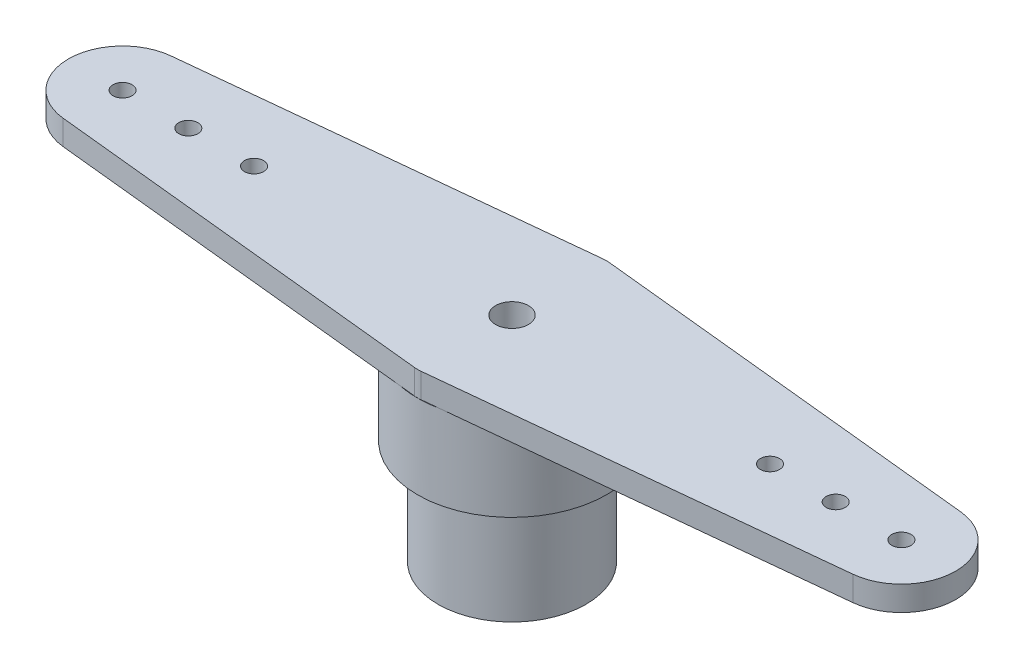
ISO-10303-21;
HEADER;
FILE_DESCRIPTION(('STEP AP214'),'2;1');
FILE_NAME('part.step','',(''),(''),'','','');
FILE_SCHEMA(('AUTOMOTIVE_DESIGN { 1 0 10303 214 1 1 1 1 }'));
ENDSEC;
DATA;
#1=APPLICATION_CONTEXT('core data for automotive mechanical design processes');
#2=APPLICATION_PROTOCOL_DEFINITION('international standard','automotive_design',2000,#1);
#3=PRODUCT_CONTEXT('',#1,'mechanical');
#4=PRODUCT('Part','Part','',(#3));
#5=PRODUCT_RELATED_PRODUCT_CATEGORY('part','',(#4));
#6=PRODUCT_DEFINITION_FORMATION('','',#4);
#7=PRODUCT_DEFINITION_CONTEXT('part definition',#1,'design');
#8=PRODUCT_DEFINITION('design','',#6,#7);
#9=PRODUCT_DEFINITION_SHAPE('','',#8);
#10=(LENGTH_UNIT() NAMED_UNIT(*) SI_UNIT(.MILLI.,.METRE.));
#11=(NAMED_UNIT(*) PLANE_ANGLE_UNIT() SI_UNIT($,.RADIAN.));
#12=(NAMED_UNIT(*) SI_UNIT($,.STERADIAN.) SOLID_ANGLE_UNIT());
#13=UNCERTAINTY_MEASURE_WITH_UNIT(LENGTH_MEASURE(1.E-05),#10,'distance_accuracy_value','');
#14=(GEOMETRIC_REPRESENTATION_CONTEXT(3) GLOBAL_UNCERTAINTY_ASSIGNED_CONTEXT((#13)) GLOBAL_UNIT_ASSIGNED_CONTEXT((#10,
#11,#12)) REPRESENTATION_CONTEXT('',''));
#15=CARTESIAN_POINT('',(0.,0.,0.));
#16=DIRECTION('',(0.,0.,1.));
#17=DIRECTION('',(1.,0.,0.));
#18=AXIS2_PLACEMENT_3D('',#15,#16,#17);
#19=CARTESIAN_POINT('',(0.,-2.55,0.));
#20=DIRECTION('',(0.,1.,0.));
#21=DIRECTION('',(0.,0.,1.));
#22=AXIS2_PLACEMENT_3D('',#19,#20,#21);
#23=PLANE('',#22);
#24=CARTESIAN_POINT('',(0.,-2.55,0.));
#25=DIRECTION('',(0.,1.,0.));
#26=DIRECTION('',(0.,0.,1.));
#27=AXIS2_PLACEMENT_3D('',#24,#25,#26);
#28=CIRCLE('',#27,2.875);
#29=CARTESIAN_POINT('',(0.,-2.55,2.875));
#30=VERTEX_POINT('',#29);
#31=EDGE_CURVE('E211',#30,#30,#28,.T.);
#32=ORIENTED_EDGE('',*,*,#31,.F.);
#33=EDGE_LOOP('',(#32));
#34=FACE_BOUND('',#33,.T.);
#35=CARTESIAN_POINT('',(0.,-2.55,0.));
#36=DIRECTION('',(0.,1.,0.));
#37=DIRECTION('',(0.,0.,1.));
#38=AXIS2_PLACEMENT_3D('',#35,#36,#37);
#39=CIRCLE('',#38,2.25);
#40=CARTESIAN_POINT('',(0.,-2.55,2.25));
#41=VERTEX_POINT('',#40);
#42=EDGE_CURVE('E218',#41,#41,#39,.F.);
#43=ORIENTED_EDGE('',*,*,#42,.F.);
#44=EDGE_LOOP('',(#43));
#45=FACE_BOUND('',#44,.T.);
#46=ADVANCED_FACE('F34',(#34,#45),#23,.F.);
#47=CARTESIAN_POINT('',(0.,0.,0.));
#48=DIRECTION('',(0.,1.,0.));
#49=DIRECTION('',(0.,0.,1.));
#50=AXIS2_PLACEMENT_3D('',#47,#48,#49);
#51=PLANE('',#50);
#52=CARTESIAN_POINT('',(0.,0.,0.));
#53=DIRECTION('',(0.,1.,0.));
#54=DIRECTION('',(0.,0.,1.));
#55=AXIS2_PLACEMENT_3D('',#52,#53,#54);
#56=CIRCLE('',#55,2.875);
#57=CARTESIAN_POINT('',(0.,0.,-2.875));
#58=VERTEX_POINT('',#57);
#59=CARTESIAN_POINT('',(-0.584049273257423,0.,-2.81505087812059));
#60=VERTEX_POINT('',#59);
#61=EDGE_CURVE('E260',#58,#60,#56,.T.);
#62=ORIENTED_EDGE('',*,*,#61,.T.);
#63=DIRECTION('',(0.994773374070749,0.,-0.102107464173283));
#64=VECTOR('',#63,1.);
#65=CARTESIAN_POINT('',(-0.292024636628711,0.,-2.84502543906029));
#66=LINE('',#65,#64);
#67=CARTESIAN_POINT('',(-0.102107464173283,0.,-2.86451928699375));
#68=VERTEX_POINT('',#67);
#69=EDGE_CURVE('E184',#60,#68,#66,.T.);
#70=ORIENTED_EDGE('',*,*,#69,.T.);
#71=CARTESIAN_POINT('',(0.,0.,-1.869745912923));
#72=DIRECTION('',(0.,1.,0.));
#73=DIRECTION('',(0.,0.,1.));
#74=AXIS2_PLACEMENT_3D('',#71,#72,#73);
#75=CIRCLE('',#74,1.);
#76=CARTESIAN_POINT('',(0.102107464173283,0.,-2.86451928699375));
#77=VERTEX_POINT('',#76);
#78=EDGE_CURVE('E11',#68,#77,#75,.F.);
#79=ORIENTED_EDGE('',*,*,#78,.T.);
#80=DIRECTION('',(-0.994773374070749,0.,-0.102107464173283));
#81=VECTOR('',#80,1.);
#82=CARTESIAN_POINT('',(0.292024636628711,0.,-2.84502543906029));
#83=LINE('',#82,#81);
#84=CARTESIAN_POINT('',(0.584049273257423,0.,-2.81505087812059));
#85=VERTEX_POINT('',#84);
#86=EDGE_CURVE('E49',#85,#77,#83,.T.);
#87=ORIENTED_EDGE('',*,*,#86,.F.);
#88=EDGE_CURVE('E262',#85,#58,#56,.T.);
#89=ORIENTED_EDGE('',*,*,#88,.T.);
#90=EDGE_LOOP('',(#62,#70,#79,#87,#89));
#91=FACE_BOUND('',#90,.T.);
#92=ADVANCED_FACE('F258',(#91),#51,.T.);
#93=CARTESIAN_POINT('',(0.,0.,2.875));
#94=VERTEX_POINT('',#93);
#95=CARTESIAN_POINT('',(0.584049273257423,0.,2.81505087812059));
#96=VERTEX_POINT('',#95);
#97=EDGE_CURVE('E214',#94,#96,#56,.T.);
#98=ORIENTED_EDGE('',*,*,#97,.T.);
#99=DIRECTION('',(-0.994773374070749,0.,0.102107464173283));
#100=VECTOR('',#99,1.);
#101=CARTESIAN_POINT('',(0.292024636628711,0.,2.84502543906029));
#102=LINE('',#101,#100);
#103=CARTESIAN_POINT('',(0.102107464173283,0.,2.86451928699375));
#104=VERTEX_POINT('',#103);
#105=EDGE_CURVE('E192',#96,#104,#102,.T.);
#106=ORIENTED_EDGE('',*,*,#105,.T.);
#107=CARTESIAN_POINT('',(0.,0.,1.869745912923));
#108=DIRECTION('',(0.,1.,0.));
#109=DIRECTION('',(0.,0.,1.));
#110=AXIS2_PLACEMENT_3D('',#107,#108,#109);
#111=CIRCLE('',#110,1.);
#112=CARTESIAN_POINT('',(-0.102107464173283,0.,2.86451928699375));
#113=VERTEX_POINT('',#112);
#114=EDGE_CURVE('E42',#104,#113,#111,.F.);
#115=ORIENTED_EDGE('',*,*,#114,.T.);
#116=DIRECTION('',(0.994773374070749,0.,0.102107464173283));
#117=VECTOR('',#116,1.);
#118=CARTESIAN_POINT('',(-0.292024636628711,0.,2.84502543906029));
#119=LINE('',#118,#117);
#120=CARTESIAN_POINT('',(-0.584049273257423,0.,2.81505087812059));
#121=VERTEX_POINT('',#120);
#122=EDGE_CURVE('E56',#121,#113,#119,.T.);
#123=ORIENTED_EDGE('',*,*,#122,.F.);
#124=EDGE_CURVE('E129',#121,#94,#56,.T.);
#125=ORIENTED_EDGE('',*,*,#124,.T.);
#126=EDGE_LOOP('',(#98,#106,#115,#123,#125));
#127=FACE_BOUND('',#126,.T.);
#128=ADVANCED_FACE('F235',(#127),#51,.T.);
#129=CARTESIAN_POINT('',(0.,-2.55,0.));
#130=DIRECTION('',(0.,1.,0.));
#131=DIRECTION('',(0.,0.,1.));
#132=AXIS2_PLACEMENT_3D('',#129,#130,#131);
#133=CYLINDRICAL_SURFACE('',#132,2.875);
#134=ORIENTED_EDGE('',*,*,#31,.T.);
#135=EDGE_LOOP('',(#134));
#136=FACE_BOUND('',#135,.T.);
#137=ORIENTED_EDGE('',*,*,#97,.F.);
#138=ORIENTED_EDGE('',*,*,#124,.F.);
#139=EDGE_CURVE('E264',#60,#121,#56,.T.);
#140=ORIENTED_EDGE('',*,*,#139,.F.);
#141=ORIENTED_EDGE('',*,*,#61,.F.);
#142=ORIENTED_EDGE('',*,*,#88,.F.);
#143=EDGE_CURVE('E217',#96,#85,#56,.T.);
#144=ORIENTED_EDGE('',*,*,#143,.F.);
#145=EDGE_LOOP('',(#137,#138,#140,#141,#142,#144));
#146=FACE_BOUND('',#145,.T.);
#147=ADVANCED_FACE('F267',(#136,#146),#133,.T.);
#148=CARTESIAN_POINT('',(0.,0.,0.));
#149=DIRECTION('',(0.,1.,0.));
#150=DIRECTION('',(0.,0.,1.));
#151=AXIS2_PLACEMENT_3D('',#148,#149,#150);
#152=PLANE('',#151);
#153=CARTESIAN_POINT('',(11.85,0.,0.));
#154=DIRECTION('',(0.,1.,0.));
#155=DIRECTION('',(0.,0.,1.));
#156=AXIS2_PLACEMENT_3D('',#153,#154,#155);
#157=CIRCLE('',#156,0.291434633875756);
#158=CARTESIAN_POINT('',(11.85,0.,0.291434633875756));
#159=VERTEX_POINT('',#158);
#160=EDGE_CURVE('E203',#159,#159,#157,.F.);
#161=ORIENTED_EDGE('',*,*,#160,.F.);
#162=EDGE_LOOP('',(#161));
#163=FACE_BOUND('',#162,.T.);
#164=CARTESIAN_POINT('',(7.85,0.,0.));
#165=DIRECTION('',(0.,1.,0.));
#166=DIRECTION('',(0.,0.,1.));
#167=AXIS2_PLACEMENT_3D('',#164,#165,#166);
#168=CIRCLE('',#167,0.291434633875755);
#169=CARTESIAN_POINT('',(7.85,0.,0.291434633875755));
#170=VERTEX_POINT('',#169);
#171=EDGE_CURVE('E200',#170,#170,#168,.F.);
#172=ORIENTED_EDGE('',*,*,#171,.F.);
#173=EDGE_LOOP('',(#172));
#174=FACE_BOUND('',#173,.T.);
#175=CARTESIAN_POINT('',(9.85,0.,0.));
#176=DIRECTION('',(0.,1.,0.));
#177=DIRECTION('',(0.,0.,1.));
#178=AXIS2_PLACEMENT_3D('',#175,#176,#177);
#179=CIRCLE('',#178,0.291434633875755);
#180=CARTESIAN_POINT('',(9.85,0.,0.291434633875755));
#181=VERTEX_POINT('',#180);
#182=EDGE_CURVE('E197',#181,#181,#179,.F.);
#183=ORIENTED_EDGE('',*,*,#182,.F.);
#184=EDGE_LOOP('',(#183));
#185=FACE_BOUND('',#184,.T.);
#186=CARTESIAN_POINT('',(12.0184773158859,0.,1.64137606721674));
#187=VERTEX_POINT('',#186);
#188=EDGE_CURVE('E188',#187,#96,#102,.T.);
#189=ORIENTED_EDGE('',*,*,#188,.T.);
#190=ORIENTED_EDGE('',*,*,#143,.T.);
#191=CARTESIAN_POINT('',(12.0184773158859,0.,-1.64137606721674));
#192=VERTEX_POINT('',#191);
#193=EDGE_CURVE('E195',#192,#85,#83,.T.);
#194=ORIENTED_EDGE('',*,*,#193,.F.);
#195=CARTESIAN_POINT('',(11.85,0.,0.));
#196=DIRECTION('',(0.,1.,0.));
#197=DIRECTION('',(0.,0.,1.));
#198=AXIS2_PLACEMENT_3D('',#195,#196,#197);
#199=CIRCLE('',#198,1.65);
#200=EDGE_CURVE('E191',#192,#187,#199,.F.);
#201=ORIENTED_EDGE('',*,*,#200,.T.);
#202=EDGE_LOOP('',(#189,#190,#194,#201));
#203=FACE_BOUND('',#202,.T.);
#204=ADVANCED_FACE('F271',(#163,#174,#185,#203),#152,.F.);
#205=CARTESIAN_POINT('',(-11.85,0.,0.));
#206=DIRECTION('',(0.,1.,0.));
#207=DIRECTION('',(0.,0.,1.));
#208=AXIS2_PLACEMENT_3D('',#205,#206,#207);
#209=CIRCLE('',#208,0.291434633875756);
#210=CARTESIAN_POINT('',(-11.85,0.,0.291434633875756));
#211=VERTEX_POINT('',#210);
#212=EDGE_CURVE('E179',#211,#211,#209,.T.);
#213=ORIENTED_EDGE('',*,*,#212,.T.);
#214=EDGE_LOOP('',(#213));
#215=FACE_BOUND('',#214,.T.);
#216=CARTESIAN_POINT('',(-9.85,0.,0.));
#217=DIRECTION('',(0.,1.,0.));
#218=DIRECTION('',(0.,0.,1.));
#219=AXIS2_PLACEMENT_3D('',#216,#217,#218);
#220=CIRCLE('',#219,0.291434633875755);
#221=CARTESIAN_POINT('',(-9.85,0.,0.291434633875755));
#222=VERTEX_POINT('',#221);
#223=EDGE_CURVE('E175',#222,#222,#220,.T.);
#224=ORIENTED_EDGE('',*,*,#223,.T.);
#225=EDGE_LOOP('',(#224));
#226=FACE_BOUND('',#225,.T.);
#227=CARTESIAN_POINT('',(-7.85,0.,0.));
#228=DIRECTION('',(0.,1.,0.));
#229=DIRECTION('',(0.,0.,1.));
#230=AXIS2_PLACEMENT_3D('',#227,#228,#229);
#231=CIRCLE('',#230,0.291434633875755);
#232=CARTESIAN_POINT('',(-7.85,0.,0.291434633875755));
#233=VERTEX_POINT('',#232);
#234=EDGE_CURVE('E172',#233,#233,#231,.T.);
#235=ORIENTED_EDGE('',*,*,#234,.T.);
#236=EDGE_LOOP('',(#235));
#237=FACE_BOUND('',#236,.T.);
#238=CARTESIAN_POINT('',(-12.0184773158859,0.,-1.64137606721674));
#239=VERTEX_POINT('',#238);
#240=EDGE_CURVE('E125',#239,#60,#66,.T.);
#241=ORIENTED_EDGE('',*,*,#240,.T.);
#242=ORIENTED_EDGE('',*,*,#139,.T.);
#243=CARTESIAN_POINT('',(-12.0184773158859,0.,1.64137606721674));
#244=VERTEX_POINT('',#243);
#245=EDGE_CURVE('E186',#244,#121,#119,.T.);
#246=ORIENTED_EDGE('',*,*,#245,.F.);
#247=CARTESIAN_POINT('',(-11.85,0.,0.));
#248=DIRECTION('',(0.,1.,0.));
#249=DIRECTION('',(0.,0.,1.));
#250=AXIS2_PLACEMENT_3D('',#247,#248,#249);
#251=CIRCLE('',#250,1.65);
#252=EDGE_CURVE('E183',#239,#244,#251,.T.);
#253=ORIENTED_EDGE('',*,*,#252,.F.);
#254=EDGE_LOOP('',(#241,#242,#246,#253));
#255=FACE_BOUND('',#254,.T.);
#256=ADVANCED_FACE('F330',(#215,#226,#237,#255),#152,.F.);
#257=CARTESIAN_POINT('',(-0.292024636628711,0.75,-2.84502543906029));
#258=DIRECTION('',(-0.102107464173283,0.,-0.994773374070749));
#259=DIRECTION('',(-0.994773374070749,0.,0.102107464173283));
#260=AXIS2_PLACEMENT_3D('',#257,#258,#259);
#261=PLANE('',#260);
#262=DIRECTION('',(0.994773374070749,0.,-0.102107464173283));
#263=VECTOR('',#262,1.);
#264=CARTESIAN_POINT('',(-0.292024636628711,0.75,-2.84502543906029));
#265=LINE('',#264,#263);
#266=CARTESIAN_POINT('',(-12.0184773158859,0.75,-1.64137606721674));
#267=VERTEX_POINT('',#266);
#268=CARTESIAN_POINT('',(-0.102107464173283,0.75,-2.86451928699375));
#269=VERTEX_POINT('',#268);
#270=EDGE_CURVE('E121',#267,#269,#265,.T.);
#271=ORIENTED_EDGE('',*,*,#270,.T.);
#272=DIRECTION('',(0.,-1.,0.));
#273=VECTOR('',#272,1.);
#274=CARTESIAN_POINT('',(-0.102107464173283,0.,-2.86451928699375));
#275=LINE('',#274,#273);
#276=EDGE_CURVE('E229',#269,#68,#275,.T.);
#277=ORIENTED_EDGE('',*,*,#276,.T.);
#278=ORIENTED_EDGE('',*,*,#69,.F.);
#279=ORIENTED_EDGE('',*,*,#240,.F.);
#280=DIRECTION('',(0.,-1.,0.));
#281=VECTOR('',#280,1.);
#282=CARTESIAN_POINT('',(-12.0184773158859,0.75,-1.64137606721674));
#283=LINE('',#282,#281);
#284=EDGE_CURVE('E116',#267,#239,#283,.T.);
#285=ORIENTED_EDGE('',*,*,#284,.F.);
#286=EDGE_LOOP('',(#271,#277,#278,#279,#285));
#287=FACE_BOUND('',#286,.T.);
#288=ADVANCED_FACE('F118',(#287),#261,.T.);
#289=CARTESIAN_POINT('',(-11.85,0.75,0.));
#290=DIRECTION('',(0.,-1.,0.));
#291=DIRECTION('',(0.,0.,-1.));
#292=AXIS2_PLACEMENT_3D('',#289,#290,#291);
#293=CYLINDRICAL_SURFACE('',#292,1.65);
#294=ORIENTED_EDGE('',*,*,#252,.T.);
#295=DIRECTION('',(0.,-1.,0.));
#296=VECTOR('',#295,1.);
#297=CARTESIAN_POINT('',(-12.0184773158859,0.75,1.64137606721674));
#298=LINE('',#297,#296);
#299=CARTESIAN_POINT('',(-12.0184773158859,0.75,1.64137606721674));
#300=VERTEX_POINT('',#299);
#301=EDGE_CURVE('E130',#300,#244,#298,.T.);
#302=ORIENTED_EDGE('',*,*,#301,.F.);
#303=CARTESIAN_POINT('',(-11.85,0.75,0.));
#304=DIRECTION('',(0.,1.,0.));
#305=DIRECTION('',(0.,0.,1.));
#306=AXIS2_PLACEMENT_3D('',#303,#304,#305);
#307=CIRCLE('',#306,1.65);
#308=EDGE_CURVE('E134',#267,#300,#307,.T.);
#309=ORIENTED_EDGE('',*,*,#308,.F.);
#310=ORIENTED_EDGE('',*,*,#284,.T.);
#311=EDGE_LOOP('',(#294,#302,#309,#310));
#312=FACE_BOUND('',#311,.T.);
#313=ADVANCED_FACE('F135',(#312),#293,.T.);
#314=CARTESIAN_POINT('',(-0.292024636628711,0.75,2.84502543906029));
#315=DIRECTION('',(0.102107464173283,0.,-0.994773374070749));
#316=DIRECTION('',(-0.994773374070749,0.,-0.102107464173283));
#317=AXIS2_PLACEMENT_3D('',#314,#315,#316);
#318=PLANE('',#317);
#319=ORIENTED_EDGE('',*,*,#122,.T.);
#320=DIRECTION('',(0.,-1.,0.));
#321=VECTOR('',#320,1.);
#322=CARTESIAN_POINT('',(-0.102107464173283,0.75,2.86451928699375));
#323=LINE('',#322,#321);
#324=CARTESIAN_POINT('',(-0.102107464173283,0.75,2.86451928699375));
#325=VERTEX_POINT('',#324);
#326=EDGE_CURVE('E224',#113,#325,#323,.F.);
#327=ORIENTED_EDGE('',*,*,#326,.T.);
#328=DIRECTION('',(0.994773374070749,0.,0.102107464173283));
#329=VECTOR('',#328,1.);
#330=CARTESIAN_POINT('',(-0.292024636628711,0.75,2.84502543906029));
#331=LINE('',#330,#329);
#332=EDGE_CURVE('E139',#300,#325,#331,.T.);
#333=ORIENTED_EDGE('',*,*,#332,.F.);
#334=ORIENTED_EDGE('',*,*,#301,.T.);
#335=ORIENTED_EDGE('',*,*,#245,.T.);
#336=EDGE_LOOP('',(#319,#327,#333,#334,#335));
#337=FACE_BOUND('',#336,.T.);
#338=ADVANCED_FACE('F243',(#337),#318,.F.);
#339=CARTESIAN_POINT('',(0.292024636628711,0.75,2.84502543906029));
#340=DIRECTION('',(0.102107464173283,0.,0.994773374070749));
#341=DIRECTION('',(0.994773374070749,0.,-0.102107464173283));
#342=AXIS2_PLACEMENT_3D('',#339,#340,#341);
#343=PLANE('',#342);
#344=DIRECTION('',(-0.994773374070749,0.,0.102107464173283));
#345=VECTOR('',#344,1.);
#346=CARTESIAN_POINT('',(0.292024636628711,0.75,2.84502543906029));
#347=LINE('',#346,#345);
#348=CARTESIAN_POINT('',(12.0184773158859,0.75,1.64137606721674));
#349=VERTEX_POINT('',#348);
#350=CARTESIAN_POINT('',(0.102107464173283,0.75,2.86451928699375));
#351=VERTEX_POINT('',#350);
#352=EDGE_CURVE('E154',#349,#351,#347,.T.);
#353=ORIENTED_EDGE('',*,*,#352,.T.);
#354=DIRECTION('',(0.,-1.,0.));
#355=VECTOR('',#354,1.);
#356=CARTESIAN_POINT('',(0.102107464173283,0.,2.86451928699375));
#357=LINE('',#356,#355);
#358=EDGE_CURVE('E221',#351,#104,#357,.T.);
#359=ORIENTED_EDGE('',*,*,#358,.T.);
#360=ORIENTED_EDGE('',*,*,#105,.F.);
#361=ORIENTED_EDGE('',*,*,#188,.F.);
#362=DIRECTION('',(0.,-1.,0.));
#363=VECTOR('',#362,1.);
#364=CARTESIAN_POINT('',(12.0184773158859,0.75,1.64137606721674));
#365=LINE('',#364,#363);
#366=EDGE_CURVE('E208',#349,#187,#365,.T.);
#367=ORIENTED_EDGE('',*,*,#366,.F.);
#368=EDGE_LOOP('',(#353,#359,#360,#361,#367));
#369=FACE_BOUND('',#368,.T.);
#370=ADVANCED_FACE('F247',(#369),#343,.T.);
#371=CARTESIAN_POINT('',(11.85,0.75,0.));
#372=DIRECTION('',(0.,-1.,0.));
#373=DIRECTION('',(0.,0.,-1.));
#374=AXIS2_PLACEMENT_3D('',#371,#372,#373);
#375=CYLINDRICAL_SURFACE('',#374,1.65);
#376=ORIENTED_EDGE('',*,*,#200,.F.);
#377=DIRECTION('',(0.,-1.,0.));
#378=VECTOR('',#377,1.);
#379=CARTESIAN_POINT('',(12.0184773158859,0.75,-1.64137606721674));
#380=LINE('',#379,#378);
#381=CARTESIAN_POINT('',(12.0184773158859,0.75,-1.64137606721674));
#382=VERTEX_POINT('',#381);
#383=EDGE_CURVE('E171',#382,#192,#380,.T.);
#384=ORIENTED_EDGE('',*,*,#383,.F.);
#385=CARTESIAN_POINT('',(11.85,0.75,0.));
#386=DIRECTION('',(0.,1.,0.));
#387=DIRECTION('',(0.,0.,1.));
#388=AXIS2_PLACEMENT_3D('',#385,#386,#387);
#389=CIRCLE('',#388,1.65);
#390=EDGE_CURVE('E157',#382,#349,#389,.F.);
#391=ORIENTED_EDGE('',*,*,#390,.T.);
#392=ORIENTED_EDGE('',*,*,#366,.T.);
#393=EDGE_LOOP('',(#376,#384,#391,#392));
#394=FACE_BOUND('',#393,.T.);
#395=ADVANCED_FACE('F251',(#394),#375,.T.);
#396=CARTESIAN_POINT('',(7.85,0.75,0.));
#397=DIRECTION('',(0.,-1.,0.));
#398=DIRECTION('',(0.,0.,-1.));
#399=AXIS2_PLACEMENT_3D('',#396,#397,#398);
#400=CYLINDRICAL_SURFACE('',#399,0.291434633875755);
#401=CARTESIAN_POINT('',(7.85,0.75,0.));
#402=DIRECTION('',(0.,1.,0.));
#403=DIRECTION('',(0.,0.,1.));
#404=AXIS2_PLACEMENT_3D('',#401,#402,#403);
#405=CIRCLE('',#404,0.291434633875755);
#406=CARTESIAN_POINT('',(7.85,0.75,0.291434633875755));
#407=VERTEX_POINT('',#406);
#408=EDGE_CURVE('E165',#407,#407,#405,.F.);
#409=ORIENTED_EDGE('',*,*,#408,.F.);
#410=EDGE_LOOP('',(#409));
#411=FACE_BOUND('',#410,.T.);
#412=ORIENTED_EDGE('',*,*,#171,.T.);
#413=EDGE_LOOP('',(#412));
#414=FACE_BOUND('',#413,.T.);
#415=ADVANCED_FACE('F284',(#411,#414),#400,.F.);
#416=CARTESIAN_POINT('',(9.85,0.75,0.));
#417=DIRECTION('',(0.,-1.,0.));
#418=DIRECTION('',(0.,0.,-1.));
#419=AXIS2_PLACEMENT_3D('',#416,#417,#418);
#420=CYLINDRICAL_SURFACE('',#419,0.291434633875755);
#421=CARTESIAN_POINT('',(9.85,0.75,0.));
#422=DIRECTION('',(0.,1.,0.));
#423=DIRECTION('',(0.,0.,1.));
#424=AXIS2_PLACEMENT_3D('',#421,#422,#423);
#425=CIRCLE('',#424,0.291434633875755);
#426=CARTESIAN_POINT('',(9.85,0.75,0.291434633875755));
#427=VERTEX_POINT('',#426);
#428=EDGE_CURVE('E162',#427,#427,#425,.F.);
#429=ORIENTED_EDGE('',*,*,#428,.F.);
#430=EDGE_LOOP('',(#429));
#431=FACE_BOUND('',#430,.T.);
#432=ORIENTED_EDGE('',*,*,#182,.T.);
#433=EDGE_LOOP('',(#432));
#434=FACE_BOUND('',#433,.T.);
#435=ADVANCED_FACE('F275',(#431,#434),#420,.F.);
#436=CARTESIAN_POINT('',(0.292024636628711,0.75,-2.84502543906029));
#437=DIRECTION('',(-0.102107464173283,0.,0.994773374070749));
#438=DIRECTION('',(0.994773374070749,0.,0.102107464173283));
#439=AXIS2_PLACEMENT_3D('',#436,#437,#438);
#440=PLANE('',#439);
#441=ORIENTED_EDGE('',*,*,#86,.T.);
#442=DIRECTION('',(0.,-1.,0.));
#443=VECTOR('',#442,1.);
#444=CARTESIAN_POINT('',(0.102107464173283,0.75,-2.86451928699375));
#445=LINE('',#444,#443);
#446=CARTESIAN_POINT('',(0.102107464173283,0.75,-2.86451928699375));
#447=VERTEX_POINT('',#446);
#448=EDGE_CURVE('E231',#77,#447,#445,.F.);
#449=ORIENTED_EDGE('',*,*,#448,.T.);
#450=DIRECTION('',(-0.994773374070749,0.,-0.102107464173283));
#451=VECTOR('',#450,1.);
#452=CARTESIAN_POINT('',(0.292024636628711,0.75,-2.84502543906029));
#453=LINE('',#452,#451);
#454=EDGE_CURVE('E160',#382,#447,#453,.T.);
#455=ORIENTED_EDGE('',*,*,#454,.F.);
#456=ORIENTED_EDGE('',*,*,#383,.T.);
#457=ORIENTED_EDGE('',*,*,#193,.T.);
#458=EDGE_LOOP('',(#441,#449,#455,#456,#457));
#459=FACE_BOUND('',#458,.T.);
#460=ADVANCED_FACE('F272',(#459),#440,.F.);
#461=CARTESIAN_POINT('',(-11.85,0.75,0.));
#462=DIRECTION('',(0.,-1.,0.));
#463=DIRECTION('',(0.,0.,-1.));
#464=AXIS2_PLACEMENT_3D('',#461,#462,#463);
#465=CYLINDRICAL_SURFACE('',#464,0.291434633875756);
#466=CARTESIAN_POINT('',(-11.85,0.75,0.));
#467=DIRECTION('',(0.,1.,0.));
#468=DIRECTION('',(0.,0.,1.));
#469=AXIS2_PLACEMENT_3D('',#466,#467,#468);
#470=CIRCLE('',#469,0.291434633875756);
#471=CARTESIAN_POINT('',(-11.85,0.75,0.291434633875756));
#472=VERTEX_POINT('',#471);
#473=EDGE_CURVE('E146',#472,#472,#470,.T.);
#474=ORIENTED_EDGE('',*,*,#473,.T.);
#475=EDGE_LOOP('',(#474));
#476=FACE_BOUND('',#475,.T.);
#477=ORIENTED_EDGE('',*,*,#212,.F.);
#478=EDGE_LOOP('',(#477));
#479=FACE_BOUND('',#478,.T.);
#480=ADVANCED_FACE('F274',(#476,#479),#465,.F.);
#481=CARTESIAN_POINT('',(-9.85,0.75,0.));
#482=DIRECTION('',(0.,-1.,0.));
#483=DIRECTION('',(0.,0.,-1.));
#484=AXIS2_PLACEMENT_3D('',#481,#482,#483);
#485=CYLINDRICAL_SURFACE('',#484,0.291434633875755);
#486=CARTESIAN_POINT('',(-9.85,0.75,0.));
#487=DIRECTION('',(0.,1.,0.));
#488=DIRECTION('',(0.,0.,1.));
#489=AXIS2_PLACEMENT_3D('',#486,#487,#488);
#490=CIRCLE('',#489,0.291434633875755);
#491=CARTESIAN_POINT('',(-9.85,0.75,0.291434633875755));
#492=VERTEX_POINT('',#491);
#493=EDGE_CURVE('E149',#492,#492,#490,.T.);
#494=ORIENTED_EDGE('',*,*,#493,.T.);
#495=EDGE_LOOP('',(#494));
#496=FACE_BOUND('',#495,.T.);
#497=ORIENTED_EDGE('',*,*,#223,.F.);
#498=EDGE_LOOP('',(#497));
#499=FACE_BOUND('',#498,.T.);
#500=ADVANCED_FACE('F281',(#496,#499),#485,.F.);
#501=CARTESIAN_POINT('',(-7.85,0.75,0.));
#502=DIRECTION('',(0.,-1.,0.));
#503=DIRECTION('',(0.,0.,-1.));
#504=AXIS2_PLACEMENT_3D('',#501,#502,#503);
#505=CYLINDRICAL_SURFACE('',#504,0.291434633875755);
#506=CARTESIAN_POINT('',(-7.85,0.75,0.));
#507=DIRECTION('',(0.,1.,0.));
#508=DIRECTION('',(0.,0.,1.));
#509=AXIS2_PLACEMENT_3D('',#506,#507,#508);
#510=CIRCLE('',#509,0.291434633875755);
#511=CARTESIAN_POINT('',(-7.85,0.75,0.291434633875755));
#512=VERTEX_POINT('',#511);
#513=EDGE_CURVE('E206',#512,#512,#510,.T.);
#514=ORIENTED_EDGE('',*,*,#513,.T.);
#515=EDGE_LOOP('',(#514));
#516=FACE_BOUND('',#515,.T.);
#517=ORIENTED_EDGE('',*,*,#234,.F.);
#518=EDGE_LOOP('',(#517));
#519=FACE_BOUND('',#518,.T.);
#520=ADVANCED_FACE('F298',(#516,#519),#505,.F.);
#521=CARTESIAN_POINT('',(11.85,0.75,0.));
#522=DIRECTION('',(0.,-1.,0.));
#523=DIRECTION('',(0.,0.,-1.));
#524=AXIS2_PLACEMENT_3D('',#521,#522,#523);
#525=CYLINDRICAL_SURFACE('',#524,0.291434633875756);
#526=CARTESIAN_POINT('',(11.85,0.75,0.));
#527=DIRECTION('',(0.,1.,0.));
#528=DIRECTION('',(0.,0.,1.));
#529=AXIS2_PLACEMENT_3D('',#526,#527,#528);
#530=CIRCLE('',#529,0.291434633875756);
#531=CARTESIAN_POINT('',(11.85,0.75,0.291434633875756));
#532=VERTEX_POINT('',#531);
#533=EDGE_CURVE('E168',#532,#532,#530,.F.);
#534=ORIENTED_EDGE('',*,*,#533,.F.);
#535=EDGE_LOOP('',(#534));
#536=FACE_BOUND('',#535,.T.);
#537=ORIENTED_EDGE('',*,*,#160,.T.);
#538=EDGE_LOOP('',(#537));
#539=FACE_BOUND('',#538,.T.);
#540=ADVANCED_FACE('F326',(#536,#539),#525,.F.);
#541=CARTESIAN_POINT('',(0.,0.75,0.));
#542=DIRECTION('',(0.,1.,0.));
#543=DIRECTION('',(0.,0.,1.));
#544=AXIS2_PLACEMENT_3D('',#541,#542,#543);
#545=PLANE('',#544);
#546=CARTESIAN_POINT('',(0.,0.75,0.));
#547=DIRECTION('',(0.,-1.,0.));
#548=DIRECTION('',(0.,0.,-1.));
#549=AXIS2_PLACEMENT_3D('',#546,#547,#548);
#550=CIRCLE('',#549,0.5);
#551=CARTESIAN_POINT('',(0.,0.75,-0.5));
#552=VERTEX_POINT('',#551);
#553=EDGE_CURVE('E535',#552,#552,#550,.T.);
#554=ORIENTED_EDGE('',*,*,#553,.T.);
#555=EDGE_LOOP('',(#554));
#556=FACE_BOUND('',#555,.T.);
#557=ORIENTED_EDGE('',*,*,#513,.F.);
#558=EDGE_LOOP('',(#557));
#559=FACE_BOUND('',#558,.T.);
#560=ORIENTED_EDGE('',*,*,#493,.F.);
#561=EDGE_LOOP('',(#560));
#562=FACE_BOUND('',#561,.T.);
#563=ORIENTED_EDGE('',*,*,#473,.F.);
#564=EDGE_LOOP('',(#563));
#565=FACE_BOUND('',#564,.T.);
#566=ORIENTED_EDGE('',*,*,#332,.T.);
#567=CARTESIAN_POINT('',(0.,0.75,1.869745912923));
#568=DIRECTION('',(0.,1.,0.));
#569=DIRECTION('',(0.,0.,1.));
#570=AXIS2_PLACEMENT_3D('',#567,#568,#569);
#571=CIRCLE('',#570,1.);
#572=EDGE_CURVE('E227',#325,#351,#571,.T.);
#573=ORIENTED_EDGE('',*,*,#572,.T.);
#574=ORIENTED_EDGE('',*,*,#352,.F.);
#575=ORIENTED_EDGE('',*,*,#390,.F.);
#576=ORIENTED_EDGE('',*,*,#454,.T.);
#577=CARTESIAN_POINT('',(0.,0.75,-1.869745912923));
#578=DIRECTION('',(0.,1.,0.));
#579=DIRECTION('',(0.,0.,1.));
#580=AXIS2_PLACEMENT_3D('',#577,#578,#579);
#581=CIRCLE('',#580,1.);
#582=EDGE_CURVE('E145',#447,#269,#581,.T.);
#583=ORIENTED_EDGE('',*,*,#582,.T.);
#584=ORIENTED_EDGE('',*,*,#270,.F.);
#585=ORIENTED_EDGE('',*,*,#308,.T.);
#586=EDGE_LOOP('',(#566,#573,#574,#575,#576,#583,#584,#585));
#587=FACE_BOUND('',#586,.T.);
#588=ORIENTED_EDGE('',*,*,#428,.T.);
#589=EDGE_LOOP('',(#588));
#590=FACE_BOUND('',#589,.T.);
#591=ORIENTED_EDGE('',*,*,#408,.T.);
#592=EDGE_LOOP('',(#591));
#593=FACE_BOUND('',#592,.T.);
#594=ORIENTED_EDGE('',*,*,#533,.T.);
#595=EDGE_LOOP('',(#594));
#596=FACE_BOUND('',#595,.T.);
#597=ADVANCED_FACE('F141',(#556,#559,#562,#565,#587,#590,#593,#596),#545,.T.);
#598=CARTESIAN_POINT('',(0.,-5.75,0.));
#599=DIRECTION('',(0.,1.,0.));
#600=DIRECTION('',(0.,0.,1.));
#601=AXIS2_PLACEMENT_3D('',#598,#599,#600);
#602=CYLINDRICAL_SURFACE('',#601,2.25);
#603=CARTESIAN_POINT('',(0.,-5.75,0.));
#604=DIRECTION('',(0.,-1.,0.));
#605=DIRECTION('',(0.,0.,-1.));
#606=AXIS2_PLACEMENT_3D('',#603,#604,#605);
#607=CIRCLE('',#606,2.25);
#608=CARTESIAN_POINT('',(0.,-5.75,-2.25));
#609=VERTEX_POINT('',#608);
#610=EDGE_CURVE('E176',#609,#609,#607,.T.);
#611=ORIENTED_EDGE('',*,*,#610,.F.);
#612=EDGE_LOOP('',(#611));
#613=FACE_BOUND('',#612,.T.);
#614=ORIENTED_EDGE('',*,*,#42,.T.);
#615=EDGE_LOOP('',(#614));
#616=FACE_BOUND('',#615,.T.);
#617=ADVANCED_FACE('F315',(#613,#616),#602,.T.);
#618=CARTESIAN_POINT('',(0.,-5.75,0.));
#619=DIRECTION('',(0.,-1.,0.));
#620=DIRECTION('',(0.,0.,-1.));
#621=AXIS2_PLACEMENT_3D('',#618,#619,#620);
#622=PLANE('',#621);
#623=CARTESIAN_POINT('',(0.,-5.75,0.));
#624=DIRECTION('',(0.,-1.,0.));
#625=DIRECTION('',(0.,0.,-1.));
#626=AXIS2_PLACEMENT_3D('',#623,#624,#625);
#627=CIRCLE('',#626,0.5);
#628=CARTESIAN_POINT('',(0.,-5.75,-0.5));
#629=VERTEX_POINT('',#628);
#630=EDGE_CURVE('E536',#629,#629,#627,.T.);
#631=ORIENTED_EDGE('',*,*,#630,.F.);
#632=EDGE_LOOP('',(#631));
#633=FACE_BOUND('',#632,.T.);
#634=ORIENTED_EDGE('',*,*,#610,.T.);
#635=EDGE_LOOP('',(#634));
#636=FACE_BOUND('',#635,.T.);
#637=ADVANCED_FACE('F309',(#633,#636),#622,.T.);
#638=CARTESIAN_POINT('',(0.,0.75,0.));
#639=DIRECTION('',(0.,-1.,0.));
#640=DIRECTION('',(0.,0.,-1.));
#641=AXIS2_PLACEMENT_3D('',#638,#639,#640);
#642=CYLINDRICAL_SURFACE('',#641,0.5);
#643=ORIENTED_EDGE('',*,*,#553,.F.);
#644=EDGE_LOOP('',(#643));
#645=FACE_BOUND('',#644,.T.);
#646=ORIENTED_EDGE('',*,*,#630,.T.);
#647=EDGE_LOOP('',(#646));
#648=FACE_BOUND('',#647,.T.);
#649=ADVANCED_FACE('F304',(#645,#648),#642,.F.);
#650=CARTESIAN_POINT('',(0.,0.75,1.869745912923));
#651=DIRECTION('',(0.,1.,0.));
#652=DIRECTION('',(0.,0.,1.));
#653=AXIS2_PLACEMENT_3D('',#650,#651,#652);
#654=CYLINDRICAL_SURFACE('',#653,1.);
#655=ORIENTED_EDGE('',*,*,#572,.F.);
#656=ORIENTED_EDGE('',*,*,#326,.F.);
#657=ORIENTED_EDGE('',*,*,#114,.F.);
#658=ORIENTED_EDGE('',*,*,#358,.F.);
#659=EDGE_LOOP('',(#655,#656,#657,#658));
#660=FACE_BOUND('',#659,.T.);
#661=ADVANCED_FACE('F242',(#660),#654,.T.);
#662=CARTESIAN_POINT('',(0.,0.75,-1.869745912923));
#663=DIRECTION('',(0.,1.,0.));
#664=DIRECTION('',(0.,0.,1.));
#665=AXIS2_PLACEMENT_3D('',#662,#663,#664);
#666=CYLINDRICAL_SURFACE('',#665,1.);
#667=ORIENTED_EDGE('',*,*,#582,.F.);
#668=ORIENTED_EDGE('',*,*,#448,.F.);
#669=ORIENTED_EDGE('',*,*,#78,.F.);
#670=ORIENTED_EDGE('',*,*,#276,.F.);
#671=EDGE_LOOP('',(#667,#668,#669,#670));
#672=FACE_BOUND('',#671,.T.);
#673=ADVANCED_FACE('F36',(#672),#666,.T.);
#674=CLOSED_SHELL('',(#46,#92,#128,#147,#204,#256,#288,#313,#338,#370,#395,#415,#435,#460,#480,
#500,#520,#540,#597,#617,#637,#649,#661,#673));
#675=MANIFOLD_SOLID_BREP('B2',#674);
#676=ADVANCED_BREP_SHAPE_REPRESENTATION('',(#18,#675),#14);
#677=SHAPE_DEFINITION_REPRESENTATION(#9,#676);
ENDSEC;
END-ISO-10303-21;
